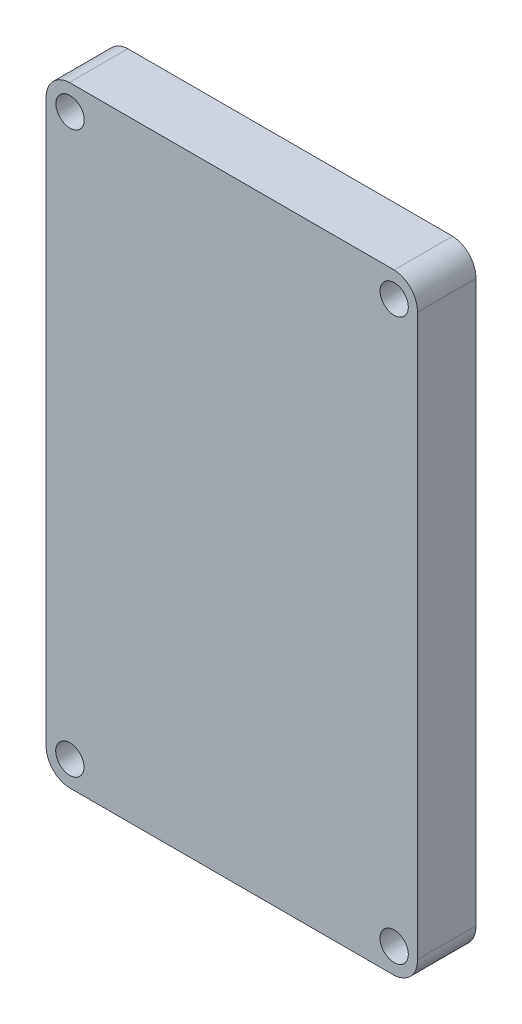
ISO-10303-21;
HEADER;
FILE_DESCRIPTION(('STEP AP214'),'2;1');
FILE_NAME('part.step','',(''),(''),'','','');
FILE_SCHEMA(('AUTOMOTIVE_DESIGN { 1 0 10303 214 1 1 1 1 }'));
ENDSEC;
DATA;
#1=APPLICATION_CONTEXT('core data for automotive mechanical design processes');
#2=APPLICATION_PROTOCOL_DEFINITION('international standard','automotive_design',2000,#1);
#3=PRODUCT_CONTEXT('',#1,'mechanical');
#4=PRODUCT('Part','Part','',(#3));
#5=PRODUCT_RELATED_PRODUCT_CATEGORY('part','',(#4));
#6=PRODUCT_DEFINITION_FORMATION('','',#4);
#7=PRODUCT_DEFINITION_CONTEXT('part definition',#1,'design');
#8=PRODUCT_DEFINITION('design','',#6,#7);
#9=PRODUCT_DEFINITION_SHAPE('','',#8);
#10=(LENGTH_UNIT() NAMED_UNIT(*) SI_UNIT(.MILLI.,.METRE.));
#11=(NAMED_UNIT(*) PLANE_ANGLE_UNIT() SI_UNIT($,.RADIAN.));
#12=(NAMED_UNIT(*) SI_UNIT($,.STERADIAN.) SOLID_ANGLE_UNIT());
#13=UNCERTAINTY_MEASURE_WITH_UNIT(LENGTH_MEASURE(1.E-05),#10,'distance_accuracy_value','');
#14=(GEOMETRIC_REPRESENTATION_CONTEXT(3) GLOBAL_UNCERTAINTY_ASSIGNED_CONTEXT((#13)) GLOBAL_UNIT_ASSIGNED_CONTEXT((#10,
#11,#12)) REPRESENTATION_CONTEXT('',''));
#15=CARTESIAN_POINT('',(0.,0.,0.));
#16=DIRECTION('',(0.,0.,1.));
#17=DIRECTION('',(1.,0.,0.));
#18=AXIS2_PLACEMENT_3D('',#15,#16,#17);
#19=CARTESIAN_POINT('',(-2.64424656626,2.644304101201,6.4));
#20=DIRECTION('',(0.,0.,1.));
#21=DIRECTION('',(1.,0.,0.));
#22=AXIS2_PLACEMENT_3D('',#19,#20,#21);
#23=PLANE('',#22);
#24=CARTESIAN_POINT('',(-38.049,2.75,6.4));
#25=DIRECTION('',(0.,0.,1.));
#26=DIRECTION('',(1.,0.,0.));
#27=AXIS2_PLACEMENT_3D('',#24,#25,#26);
#28=CIRCLE('',#27,1.55);
#29=CARTESIAN_POINT('',(-36.499,2.75,6.4));
#30=VERTEX_POINT('',#29);
#31=EDGE_CURVE('E193',#30,#30,#28,.T.);
#32=ORIENTED_EDGE('',*,*,#31,.F.);
#33=EDGE_LOOP('',(#32));
#34=FACE_BOUND('',#33,.T.);
#35=CARTESIAN_POINT('',(-2.54,2.75,6.4));
#36=DIRECTION('',(0.,0.,1.));
#37=DIRECTION('',(1.,0.,0.));
#38=AXIS2_PLACEMENT_3D('',#35,#36,#37);
#39=CIRCLE('',#38,1.55);
#40=CARTESIAN_POINT('',(-0.99,2.75,6.4));
#41=VERTEX_POINT('',#40);
#42=EDGE_CURVE('E139',#41,#41,#39,.T.);
#43=ORIENTED_EDGE('',*,*,#42,.F.);
#44=EDGE_LOOP('',(#43));
#45=FACE_BOUND('',#44,.T.);
#46=CARTESIAN_POINT('',(-2.64424656626,2.644304101201,6.4));
#47=DIRECTION('',(0.,0.,1.));
#48=DIRECTION('',(1.,0.,0.));
#49=AXIS2_PLACEMENT_3D('',#46,#47,#48);
#50=CIRCLE('',#49,2.64635816287272);
#51=CARTESIAN_POINT('',(-2.54,0.,6.4));
#52=VERTEX_POINT('',#51);
#53=CARTESIAN_POINT('',(0.,2.75,6.4));
#54=VERTEX_POINT('',#53);
#55=EDGE_CURVE('E150',#52,#54,#50,.T.);
#56=ORIENTED_EDGE('',*,*,#55,.T.);
#57=DIRECTION('',(0.,1.,0.));
#58=VECTOR('',#57,1.);
#59=CARTESIAN_POINT('',(0.,2.75,6.4));
#60=LINE('',#59,#58);
#61=CARTESIAN_POINT('',(0.,64.13,6.4));
#62=VERTEX_POINT('',#61);
#63=EDGE_CURVE('E98',#54,#62,#60,.T.);
#64=ORIENTED_EDGE('',*,*,#63,.T.);
#65=CARTESIAN_POINT('',(-2.64424656626,64.235695898799,6.4));
#66=DIRECTION('',(0.,0.,1.));
#67=DIRECTION('',(1.,0.,0.));
#68=AXIS2_PLACEMENT_3D('',#65,#66,#67);
#69=CIRCLE('',#68,2.64635816287249);
#70=CARTESIAN_POINT('',(-2.54000000000003,66.8799999999993,6.4));
#71=VERTEX_POINT('',#70);
#72=EDGE_CURVE('E165',#62,#71,#69,.T.);
#73=ORIENTED_EDGE('',*,*,#72,.T.);
#74=DIRECTION('',(-1.,0.,0.));
#75=VECTOR('',#74,1.);
#76=CARTESIAN_POINT('',(-2.54000000000002,66.8799999999996,6.4));
#77=LINE('',#76,#75);
#78=CARTESIAN_POINT('',(-38.1,66.88,6.4));
#79=VERTEX_POINT('',#78);
#80=EDGE_CURVE('E178',#71,#79,#77,.T.);
#81=ORIENTED_EDGE('',*,*,#80,.T.);
#82=CARTESIAN_POINT('',(-37.99575343374,64.235695898799,6.4));
#83=DIRECTION('',(0.,0.,1.));
#84=DIRECTION('',(1.,0.,0.));
#85=AXIS2_PLACEMENT_3D('',#82,#83,#84);
#86=CIRCLE('',#85,2.64635816287294);
#87=CARTESIAN_POINT('',(-40.6400000000007,64.13,6.4));
#88=VERTEX_POINT('',#87);
#89=EDGE_CURVE('E117',#79,#88,#86,.T.);
#90=ORIENTED_EDGE('',*,*,#89,.T.);
#91=DIRECTION('',(0.,-1.,0.));
#92=VECTOR('',#91,1.);
#93=CARTESIAN_POINT('',(-40.6400000000004,64.13,6.4));
#94=LINE('',#93,#92);
#95=CARTESIAN_POINT('',(-40.64,2.75,6.4));
#96=VERTEX_POINT('',#95);
#97=EDGE_CURVE('E111',#88,#96,#94,.T.);
#98=ORIENTED_EDGE('',*,*,#97,.T.);
#99=CARTESIAN_POINT('',(-37.995753433739,2.644304101201,6.4));
#100=DIRECTION('',(0.,0.,1.));
#101=DIRECTION('',(1.,0.,0.));
#102=AXIS2_PLACEMENT_3D('',#99,#100,#101);
#103=CIRCLE('',#102,2.64635816287326);
#104=CARTESIAN_POINT('',(-38.1,0.,6.4));
#105=VERTEX_POINT('',#104);
#106=EDGE_CURVE('E115',#96,#105,#103,.T.);
#107=ORIENTED_EDGE('',*,*,#106,.T.);
#108=DIRECTION('',(1.,0.,0.));
#109=VECTOR('',#108,1.);
#110=CARTESIAN_POINT('',(-38.1,0.,6.4));
#111=LINE('',#110,#109);
#112=EDGE_CURVE('E55',#105,#52,#111,.T.);
#113=ORIENTED_EDGE('',*,*,#112,.T.);
#114=EDGE_LOOP('',(#56,#64,#73,#81,#90,#98,#107,#113));
#115=FACE_BOUND('',#114,.T.);
#116=CARTESIAN_POINT('',(-2.54,64.13,6.4));
#117=DIRECTION('',(0.,0.,1.));
#118=DIRECTION('',(1.,0.,0.));
#119=AXIS2_PLACEMENT_3D('',#116,#117,#118);
#120=CIRCLE('',#119,1.55);
#121=CARTESIAN_POINT('',(-0.990000000000003,64.13,6.4));
#122=VERTEX_POINT('',#121);
#123=EDGE_CURVE('E187',#122,#122,#120,.T.);
#124=ORIENTED_EDGE('',*,*,#123,.F.);
#125=EDGE_LOOP('',(#124));
#126=FACE_BOUND('',#125,.T.);
#127=CARTESIAN_POINT('',(-38.024,64.13,6.4));
#128=DIRECTION('',(0.,0.,1.));
#129=DIRECTION('',(1.,0.,0.));
#130=AXIS2_PLACEMENT_3D('',#127,#128,#129);
#131=CIRCLE('',#130,1.54999999999999);
#132=CARTESIAN_POINT('',(-36.474,64.13,6.4));
#133=VERTEX_POINT('',#132);
#134=EDGE_CURVE('E199',#133,#133,#131,.T.);
#135=ORIENTED_EDGE('',*,*,#134,.F.);
#136=EDGE_LOOP('',(#135));
#137=FACE_BOUND('',#136,.T.);
#138=ADVANCED_FACE('F38',(#34,#45,#115,#126,#137),#23,.T.);
#139=CARTESIAN_POINT('',(-2.64424656626,2.644304101201,0.));
#140=DIRECTION('',(0.,0.,1.));
#141=DIRECTION('',(1.,0.,0.));
#142=AXIS2_PLACEMENT_3D('',#139,#140,#141);
#143=PLANE('',#142);
#144=CARTESIAN_POINT('',(-2.64424656626,2.644304101201,0.));
#145=DIRECTION('',(0.,0.,1.));
#146=DIRECTION('',(1.,0.,0.));
#147=AXIS2_PLACEMENT_3D('',#144,#145,#146);
#148=CIRCLE('',#147,2.64635816287272);
#149=CARTESIAN_POINT('',(-2.54,0.,0.));
#150=VERTEX_POINT('',#149);
#151=CARTESIAN_POINT('',(0.,2.75,0.));
#152=VERTEX_POINT('',#151);
#153=EDGE_CURVE('E135',#150,#152,#148,.T.);
#154=ORIENTED_EDGE('',*,*,#153,.F.);
#155=DIRECTION('',(1.,0.,0.));
#156=VECTOR('',#155,1.);
#157=CARTESIAN_POINT('',(-38.1,0.,0.));
#158=LINE('',#157,#156);
#159=CARTESIAN_POINT('',(-38.1,0.,0.));
#160=VERTEX_POINT('',#159);
#161=EDGE_CURVE('E90',#160,#150,#158,.T.);
#162=ORIENTED_EDGE('',*,*,#161,.F.);
#163=CARTESIAN_POINT('',(-37.995753433739,2.644304101201,0.));
#164=DIRECTION('',(0.,0.,1.));
#165=DIRECTION('',(1.,0.,0.));
#166=AXIS2_PLACEMENT_3D('',#163,#164,#165);
#167=CIRCLE('',#166,2.64635816287326);
#168=CARTESIAN_POINT('',(-40.64,2.75,0.));
#169=VERTEX_POINT('',#168);
#170=EDGE_CURVE('E84',#169,#160,#167,.T.);
#171=ORIENTED_EDGE('',*,*,#170,.F.);
#172=DIRECTION('',(0.,-1.,0.));
#173=VECTOR('',#172,1.);
#174=CARTESIAN_POINT('',(-40.6400000000004,64.13,0.));
#175=LINE('',#174,#173);
#176=CARTESIAN_POINT('',(-40.6400000000007,64.13,0.));
#177=VERTEX_POINT('',#176);
#178=EDGE_CURVE('E125',#177,#169,#175,.T.);
#179=ORIENTED_EDGE('',*,*,#178,.F.);
#180=CARTESIAN_POINT('',(-37.99575343374,64.235695898799,0.));
#181=DIRECTION('',(0.,0.,1.));
#182=DIRECTION('',(1.,0.,0.));
#183=AXIS2_PLACEMENT_3D('',#180,#181,#182);
#184=CIRCLE('',#183,2.64635816287294);
#185=CARTESIAN_POINT('',(-38.1,66.88,0.));
#186=VERTEX_POINT('',#185);
#187=EDGE_CURVE('E145',#186,#177,#184,.T.);
#188=ORIENTED_EDGE('',*,*,#187,.F.);
#189=DIRECTION('',(-1.,0.,0.));
#190=VECTOR('',#189,1.);
#191=CARTESIAN_POINT('',(-2.54000000000002,66.8799999999996,0.));
#192=LINE('',#191,#190);
#193=CARTESIAN_POINT('',(-2.54000000000003,66.8799999999993,0.));
#194=VERTEX_POINT('',#193);
#195=EDGE_CURVE('E143',#194,#186,#192,.T.);
#196=ORIENTED_EDGE('',*,*,#195,.F.);
#197=CARTESIAN_POINT('',(-2.64424656626,64.235695898799,0.));
#198=DIRECTION('',(0.,0.,1.));
#199=DIRECTION('',(1.,0.,0.));
#200=AXIS2_PLACEMENT_3D('',#197,#198,#199);
#201=CIRCLE('',#200,2.64635816287249);
#202=CARTESIAN_POINT('',(0.,64.13,0.));
#203=VERTEX_POINT('',#202);
#204=EDGE_CURVE('E141',#203,#194,#201,.T.);
#205=ORIENTED_EDGE('',*,*,#204,.F.);
#206=DIRECTION('',(0.,1.,0.));
#207=VECTOR('',#206,1.);
#208=CARTESIAN_POINT('',(0.,2.75,0.));
#209=LINE('',#208,#207);
#210=EDGE_CURVE('E138',#152,#203,#209,.T.);
#211=ORIENTED_EDGE('',*,*,#210,.F.);
#212=EDGE_LOOP('',(#154,#162,#171,#179,#188,#196,#205,#211));
#213=FACE_BOUND('',#212,.T.);
#214=CARTESIAN_POINT('',(-2.54,2.75,0.));
#215=DIRECTION('',(0.,0.,1.));
#216=DIRECTION('',(1.,0.,0.));
#217=AXIS2_PLACEMENT_3D('',#214,#215,#216);
#218=CIRCLE('',#217,1.55);
#219=CARTESIAN_POINT('',(-0.99,2.75,0.));
#220=VERTEX_POINT('',#219);
#221=EDGE_CURVE('E184',#220,#220,#218,.T.);
#222=ORIENTED_EDGE('',*,*,#221,.T.);
#223=EDGE_LOOP('',(#222));
#224=FACE_BOUND('',#223,.T.);
#225=CARTESIAN_POINT('',(-2.54,64.13,0.));
#226=DIRECTION('',(0.,0.,1.));
#227=DIRECTION('',(1.,0.,0.));
#228=AXIS2_PLACEMENT_3D('',#225,#226,#227);
#229=CIRCLE('',#228,1.55);
#230=CARTESIAN_POINT('',(-0.990000000000003,64.13,0.));
#231=VERTEX_POINT('',#230);
#232=EDGE_CURVE('E190',#231,#231,#229,.T.);
#233=ORIENTED_EDGE('',*,*,#232,.T.);
#234=EDGE_LOOP('',(#233));
#235=FACE_BOUND('',#234,.T.);
#236=CARTESIAN_POINT('',(-38.049,2.75,0.));
#237=DIRECTION('',(0.,0.,1.));
#238=DIRECTION('',(1.,0.,0.));
#239=AXIS2_PLACEMENT_3D('',#236,#237,#238);
#240=CIRCLE('',#239,1.55);
#241=CARTESIAN_POINT('',(-36.499,2.75,0.));
#242=VERTEX_POINT('',#241);
#243=EDGE_CURVE('E196',#242,#242,#240,.T.);
#244=ORIENTED_EDGE('',*,*,#243,.T.);
#245=EDGE_LOOP('',(#244));
#246=FACE_BOUND('',#245,.T.);
#247=CARTESIAN_POINT('',(-38.024,64.13,0.));
#248=DIRECTION('',(0.,0.,1.));
#249=DIRECTION('',(1.,0.,0.));
#250=AXIS2_PLACEMENT_3D('',#247,#248,#249);
#251=CIRCLE('',#250,1.54999999999999);
#252=CARTESIAN_POINT('',(-36.474,64.13,0.));
#253=VERTEX_POINT('',#252);
#254=EDGE_CURVE('E202',#253,#253,#251,.T.);
#255=ORIENTED_EDGE('',*,*,#254,.T.);
#256=EDGE_LOOP('',(#255));
#257=FACE_BOUND('',#256,.T.);
#258=ADVANCED_FACE('F169',(#213,#224,#235,#246,#257),#143,.F.);
#259=CARTESIAN_POINT('',(-2.64424656626,2.644304101201,6.4));
#260=DIRECTION('',(0.,0.,-1.));
#261=DIRECTION('',(-1.,0.,0.));
#262=AXIS2_PLACEMENT_3D('',#259,#260,#261);
#263=CYLINDRICAL_SURFACE('',#262,2.64635816287272);
#264=ORIENTED_EDGE('',*,*,#153,.T.);
#265=DIRECTION('',(0.,0.,-1.));
#266=VECTOR('',#265,1.);
#267=CARTESIAN_POINT('',(0.,2.75,6.4));
#268=LINE('',#267,#266);
#269=EDGE_CURVE('E11',#54,#152,#268,.T.);
#270=ORIENTED_EDGE('',*,*,#269,.F.);
#271=ORIENTED_EDGE('',*,*,#55,.F.);
#272=DIRECTION('',(0.,0.,-1.));
#273=VECTOR('',#272,1.);
#274=CARTESIAN_POINT('',(-2.54,0.,6.4));
#275=LINE('',#274,#273);
#276=EDGE_CURVE('E131',#52,#150,#275,.T.);
#277=ORIENTED_EDGE('',*,*,#276,.T.);
#278=EDGE_LOOP('',(#264,#270,#271,#277));
#279=FACE_BOUND('',#278,.T.);
#280=ADVANCED_FACE('F40',(#279),#263,.T.);
#281=CARTESIAN_POINT('',(0.,2.75,6.4));
#282=DIRECTION('',(-1.,0.,0.));
#283=DIRECTION('',(0.,-1.,0.));
#284=AXIS2_PLACEMENT_3D('',#281,#282,#283);
#285=PLANE('',#284);
#286=ORIENTED_EDGE('',*,*,#210,.T.);
#287=DIRECTION('',(0.,0.,-1.));
#288=VECTOR('',#287,1.);
#289=CARTESIAN_POINT('',(0.,64.13,6.4));
#290=LINE('',#289,#288);
#291=EDGE_CURVE('E47',#62,#203,#290,.T.);
#292=ORIENTED_EDGE('',*,*,#291,.F.);
#293=ORIENTED_EDGE('',*,*,#63,.F.);
#294=ORIENTED_EDGE('',*,*,#269,.T.);
#295=EDGE_LOOP('',(#286,#292,#293,#294));
#296=FACE_BOUND('',#295,.T.);
#297=ADVANCED_FACE('F236',(#296),#285,.F.);
#298=CARTESIAN_POINT('',(-2.64424656626,64.235695898799,6.4));
#299=DIRECTION('',(0.,0.,-1.));
#300=DIRECTION('',(-1.,0.,0.));
#301=AXIS2_PLACEMENT_3D('',#298,#299,#300);
#302=CYLINDRICAL_SURFACE('',#301,2.64635816287249);
#303=ORIENTED_EDGE('',*,*,#204,.T.);
#304=DIRECTION('',(0.,0.,-1.));
#305=VECTOR('',#304,1.);
#306=CARTESIAN_POINT('',(-2.54000000000003,66.8799999999993,6.4));
#307=LINE('',#306,#305);
#308=EDGE_CURVE('E157',#71,#194,#307,.T.);
#309=ORIENTED_EDGE('',*,*,#308,.F.);
#310=ORIENTED_EDGE('',*,*,#72,.F.);
#311=ORIENTED_EDGE('',*,*,#291,.T.);
#312=EDGE_LOOP('',(#303,#309,#310,#311));
#313=FACE_BOUND('',#312,.T.);
#314=ADVANCED_FACE('F163',(#313),#302,.T.);
#315=CARTESIAN_POINT('',(-2.54000000000002,66.8799999999996,6.4));
#316=DIRECTION('',(0.,-1.,0.));
#317=DIRECTION('',(1.,0.,0.));
#318=AXIS2_PLACEMENT_3D('',#315,#316,#317);
#319=PLANE('',#318);
#320=ORIENTED_EDGE('',*,*,#195,.T.);
#321=DIRECTION('',(0.,0.,-1.));
#322=VECTOR('',#321,1.);
#323=CARTESIAN_POINT('',(-38.1,66.88,6.4));
#324=LINE('',#323,#322);
#325=EDGE_CURVE('E154',#79,#186,#324,.T.);
#326=ORIENTED_EDGE('',*,*,#325,.F.);
#327=ORIENTED_EDGE('',*,*,#80,.F.);
#328=ORIENTED_EDGE('',*,*,#308,.T.);
#329=EDGE_LOOP('',(#320,#326,#327,#328));
#330=FACE_BOUND('',#329,.T.);
#331=ADVANCED_FACE('F174',(#330),#319,.F.);
#332=CARTESIAN_POINT('',(-37.99575343374,64.235695898799,6.4));
#333=DIRECTION('',(0.,0.,-1.));
#334=DIRECTION('',(-1.,0.,0.));
#335=AXIS2_PLACEMENT_3D('',#332,#333,#334);
#336=CYLINDRICAL_SURFACE('',#335,2.64635816287294);
#337=ORIENTED_EDGE('',*,*,#187,.T.);
#338=DIRECTION('',(0.,0.,-1.));
#339=VECTOR('',#338,1.);
#340=CARTESIAN_POINT('',(-40.6400000000007,64.13,6.4));
#341=LINE('',#340,#339);
#342=EDGE_CURVE('E126',#88,#177,#341,.T.);
#343=ORIENTED_EDGE('',*,*,#342,.F.);
#344=ORIENTED_EDGE('',*,*,#89,.F.);
#345=ORIENTED_EDGE('',*,*,#325,.T.);
#346=EDGE_LOOP('',(#337,#343,#344,#345));
#347=FACE_BOUND('',#346,.T.);
#348=ADVANCED_FACE('F177',(#347),#336,.T.);
#349=CARTESIAN_POINT('',(-40.6400000000004,64.13,6.4));
#350=DIRECTION('',(1.,0.,0.));
#351=DIRECTION('',(0.,1.,0.));
#352=AXIS2_PLACEMENT_3D('',#349,#350,#351);
#353=PLANE('',#352);
#354=ORIENTED_EDGE('',*,*,#178,.T.);
#355=DIRECTION('',(0.,0.,-1.));
#356=VECTOR('',#355,1.);
#357=CARTESIAN_POINT('',(-40.64,2.75,6.4));
#358=LINE('',#357,#356);
#359=EDGE_CURVE('E122',#96,#169,#358,.T.);
#360=ORIENTED_EDGE('',*,*,#359,.F.);
#361=ORIENTED_EDGE('',*,*,#97,.F.);
#362=ORIENTED_EDGE('',*,*,#342,.T.);
#363=EDGE_LOOP('',(#354,#360,#361,#362));
#364=FACE_BOUND('',#363,.T.);
#365=ADVANCED_FACE('F123',(#364),#353,.F.);
#366=CARTESIAN_POINT('',(-37.995753433739,2.644304101201,6.4));
#367=DIRECTION('',(0.,0.,-1.));
#368=DIRECTION('',(-1.,0.,0.));
#369=AXIS2_PLACEMENT_3D('',#366,#367,#368);
#370=CYLINDRICAL_SURFACE('',#369,2.64635816287326);
#371=ORIENTED_EDGE('',*,*,#170,.T.);
#372=DIRECTION('',(0.,0.,-1.));
#373=VECTOR('',#372,1.);
#374=CARTESIAN_POINT('',(-38.1,0.,6.4));
#375=LINE('',#374,#373);
#376=EDGE_CURVE('E127',#105,#160,#375,.T.);
#377=ORIENTED_EDGE('',*,*,#376,.F.);
#378=ORIENTED_EDGE('',*,*,#106,.F.);
#379=ORIENTED_EDGE('',*,*,#359,.T.);
#380=EDGE_LOOP('',(#371,#377,#378,#379));
#381=FACE_BOUND('',#380,.T.);
#382=ADVANCED_FACE('F129',(#381),#370,.T.);
#383=CARTESIAN_POINT('',(-38.1,0.,6.4));
#384=DIRECTION('',(0.,1.,0.));
#385=DIRECTION('',(-1.,0.,0.));
#386=AXIS2_PLACEMENT_3D('',#383,#384,#385);
#387=PLANE('',#386);
#388=ORIENTED_EDGE('',*,*,#161,.T.);
#389=ORIENTED_EDGE('',*,*,#276,.F.);
#390=ORIENTED_EDGE('',*,*,#112,.F.);
#391=ORIENTED_EDGE('',*,*,#376,.T.);
#392=EDGE_LOOP('',(#388,#389,#390,#391));
#393=FACE_BOUND('',#392,.T.);
#394=ADVANCED_FACE('F224',(#393),#387,.F.);
#395=CARTESIAN_POINT('',(-2.54,2.75,6.4));
#396=DIRECTION('',(0.,0.,-1.));
#397=DIRECTION('',(-1.,0.,0.));
#398=AXIS2_PLACEMENT_3D('',#395,#396,#397);
#399=CYLINDRICAL_SURFACE('',#398,1.55);
#400=ORIENTED_EDGE('',*,*,#42,.T.);
#401=EDGE_LOOP('',(#400));
#402=FACE_BOUND('',#401,.T.);
#403=ORIENTED_EDGE('',*,*,#221,.F.);
#404=EDGE_LOOP('',(#403));
#405=FACE_BOUND('',#404,.T.);
#406=ADVANCED_FACE('F221',(#402,#405),#399,.F.);
#407=CARTESIAN_POINT('',(-2.54,64.13,6.4));
#408=DIRECTION('',(0.,0.,-1.));
#409=DIRECTION('',(-1.,0.,0.));
#410=AXIS2_PLACEMENT_3D('',#407,#408,#409);
#411=CYLINDRICAL_SURFACE('',#410,1.55);
#412=ORIENTED_EDGE('',*,*,#123,.T.);
#413=EDGE_LOOP('',(#412));
#414=FACE_BOUND('',#413,.T.);
#415=ORIENTED_EDGE('',*,*,#232,.F.);
#416=EDGE_LOOP('',(#415));
#417=FACE_BOUND('',#416,.T.);
#418=ADVANCED_FACE('F312',(#414,#417),#411,.F.);
#419=CARTESIAN_POINT('',(-38.049,2.75,6.4));
#420=DIRECTION('',(0.,0.,-1.));
#421=DIRECTION('',(-1.,0.,0.));
#422=AXIS2_PLACEMENT_3D('',#419,#420,#421);
#423=CYLINDRICAL_SURFACE('',#422,1.55);
#424=ORIENTED_EDGE('',*,*,#31,.T.);
#425=EDGE_LOOP('',(#424));
#426=FACE_BOUND('',#425,.T.);
#427=ORIENTED_EDGE('',*,*,#243,.F.);
#428=EDGE_LOOP('',(#427));
#429=FACE_BOUND('',#428,.T.);
#430=ADVANCED_FACE('F321',(#426,#429),#423,.F.);
#431=CARTESIAN_POINT('',(-38.024,64.13,6.4));
#432=DIRECTION('',(0.,0.,-1.));
#433=DIRECTION('',(-1.,0.,0.));
#434=AXIS2_PLACEMENT_3D('',#431,#432,#433);
#435=CYLINDRICAL_SURFACE('',#434,1.54999999999999);
#436=ORIENTED_EDGE('',*,*,#134,.T.);
#437=EDGE_LOOP('',(#436));
#438=FACE_BOUND('',#437,.T.);
#439=ORIENTED_EDGE('',*,*,#254,.F.);
#440=EDGE_LOOP('',(#439));
#441=FACE_BOUND('',#440,.T.);
#442=ADVANCED_FACE('F208',(#438,#441),#435,.F.);
#443=CLOSED_SHELL('',(#138,#258,#280,#297,#314,#331,#348,#365,#382,#394,#406,#418,#430,#442));
#444=MANIFOLD_SOLID_BREP('B2',#443);
#445=ADVANCED_BREP_SHAPE_REPRESENTATION('',(#18,#444),#14);
#446=SHAPE_DEFINITION_REPRESENTATION(#9,#445);
ENDSEC;
END-ISO-10303-21;
